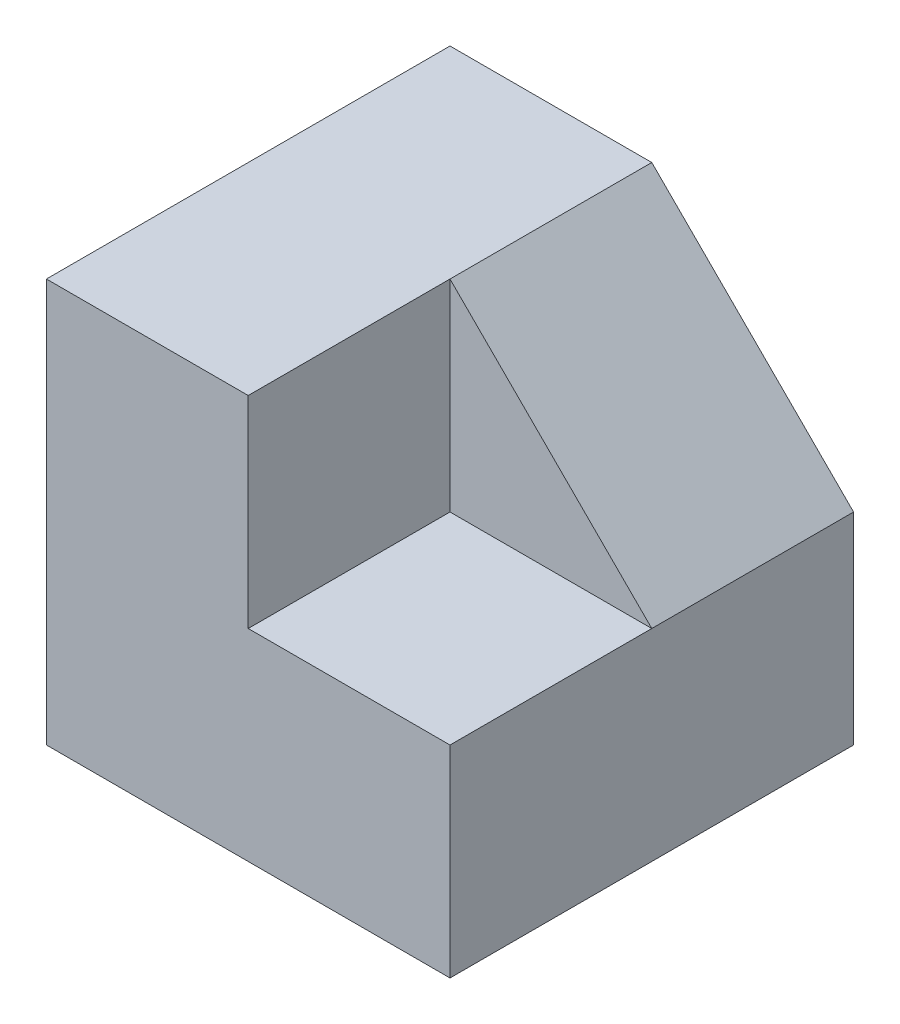
ISO-10303-21;
HEADER;
FILE_DESCRIPTION(('STEP AP214'),'2;1');
FILE_NAME('part.step','',(''),(''),'','','');
FILE_SCHEMA(('AUTOMOTIVE_DESIGN { 1 0 10303 214 1 1 1 1 }'));
ENDSEC;
DATA;
#1=APPLICATION_CONTEXT('core data for automotive mechanical design processes');
#2=APPLICATION_PROTOCOL_DEFINITION('international standard','automotive_design',2000,#1);
#3=PRODUCT_CONTEXT('',#1,'mechanical');
#4=PRODUCT('Part','Part','',(#3));
#5=PRODUCT_RELATED_PRODUCT_CATEGORY('part','',(#4));
#6=PRODUCT_DEFINITION_FORMATION('','',#4);
#7=PRODUCT_DEFINITION_CONTEXT('part definition',#1,'design');
#8=PRODUCT_DEFINITION('design','',#6,#7);
#9=PRODUCT_DEFINITION_SHAPE('','',#8);
#10=(LENGTH_UNIT() NAMED_UNIT(*) SI_UNIT(.MILLI.,.METRE.));
#11=(NAMED_UNIT(*) PLANE_ANGLE_UNIT() SI_UNIT($,.RADIAN.));
#12=(NAMED_UNIT(*) SI_UNIT($,.STERADIAN.) SOLID_ANGLE_UNIT());
#13=UNCERTAINTY_MEASURE_WITH_UNIT(LENGTH_MEASURE(1.E-05),#10,'distance_accuracy_value','');
#14=(GEOMETRIC_REPRESENTATION_CONTEXT(3) GLOBAL_UNCERTAINTY_ASSIGNED_CONTEXT((#13)) GLOBAL_UNIT_ASSIGNED_CONTEXT((#10,
#11,#12)) REPRESENTATION_CONTEXT('',''));
#15=CARTESIAN_POINT('',(0.,0.,0.));
#16=DIRECTION('',(0.,0.,1.));
#17=DIRECTION('',(1.,0.,0.));
#18=AXIS2_PLACEMENT_3D('',#15,#16,#17);
#19=CARTESIAN_POINT('',(0.,60.,0.));
#20=DIRECTION('',(1.,0.,0.));
#21=DIRECTION('',(0.,0.,-1.));
#22=AXIS2_PLACEMENT_3D('',#19,#20,#21);
#23=PLANE('',#22);
#24=DIRECTION('',(0.,0.,1.));
#25=VECTOR('',#24,1.);
#26=CARTESIAN_POINT('',(0.,0.,0.));
#27=LINE('',#26,#25);
#28=CARTESIAN_POINT('',(0.,0.,0.));
#29=VERTEX_POINT('',#28);
#30=CARTESIAN_POINT('',(0.,0.,60.));
#31=VERTEX_POINT('',#30);
#32=EDGE_CURVE('E92',#29,#31,#27,.T.);
#33=ORIENTED_EDGE('',*,*,#32,.T.);
#34=DIRECTION('',(0.,-1.,0.));
#35=VECTOR('',#34,1.);
#36=CARTESIAN_POINT('',(0.,60.,60.));
#37=LINE('',#36,#35);
#38=CARTESIAN_POINT('',(0.,60.,60.));
#39=VERTEX_POINT('',#38);
#40=EDGE_CURVE('E11',#39,#31,#37,.T.);
#41=ORIENTED_EDGE('',*,*,#40,.F.);
#42=DIRECTION('',(0.,0.,1.));
#43=VECTOR('',#42,1.);
#44=CARTESIAN_POINT('',(0.,60.,0.));
#45=LINE('',#44,#43);
#46=CARTESIAN_POINT('',(0.,60.,0.));
#47=VERTEX_POINT('',#46);
#48=EDGE_CURVE('E86',#47,#39,#45,.T.);
#49=ORIENTED_EDGE('',*,*,#48,.F.);
#50=DIRECTION('',(0.,-1.,0.));
#51=VECTOR('',#50,1.);
#52=CARTESIAN_POINT('',(0.,60.,0.));
#53=LINE('',#52,#51);
#54=EDGE_CURVE('E80',#47,#29,#53,.T.);
#55=ORIENTED_EDGE('',*,*,#54,.T.);
#56=EDGE_LOOP('',(#33,#41,#49,#55));
#57=FACE_BOUND('',#56,.T.);
#58=ADVANCED_FACE('F39',(#57),#23,.F.);
#59=CARTESIAN_POINT('',(0.,60.,60.));
#60=DIRECTION('',(0.,0.,-1.));
#61=DIRECTION('',(-1.,0.,0.));
#62=AXIS2_PLACEMENT_3D('',#59,#60,#61);
#63=PLANE('',#62);
#64=DIRECTION('',(1.,0.,0.));
#65=VECTOR('',#64,1.);
#66=CARTESIAN_POINT('',(60.,30.,60.));
#67=LINE('',#66,#65);
#68=CARTESIAN_POINT('',(30.,30.,60.));
#69=VERTEX_POINT('',#68);
#70=CARTESIAN_POINT('',(60.,30.,60.));
#71=VERTEX_POINT('',#70);
#72=EDGE_CURVE('E136',#69,#71,#67,.T.);
#73=ORIENTED_EDGE('',*,*,#72,.F.);
#74=DIRECTION('',(0.,1.,0.));
#75=VECTOR('',#74,1.);
#76=CARTESIAN_POINT('',(30.,30.,60.));
#77=LINE('',#76,#75);
#78=CARTESIAN_POINT('',(30.,60.,60.));
#79=VERTEX_POINT('',#78);
#80=EDGE_CURVE('E99',#69,#79,#77,.T.);
#81=ORIENTED_EDGE('',*,*,#80,.T.);
#82=DIRECTION('',(1.,0.,0.));
#83=VECTOR('',#82,1.);
#84=CARTESIAN_POINT('',(0.,60.,60.));
#85=LINE('',#84,#83);
#86=EDGE_CURVE('E125',#39,#79,#85,.T.);
#87=ORIENTED_EDGE('',*,*,#86,.F.);
#88=ORIENTED_EDGE('',*,*,#40,.T.);
#89=DIRECTION('',(1.,0.,0.));
#90=VECTOR('',#89,1.);
#91=CARTESIAN_POINT('',(0.,0.,60.));
#92=LINE('',#91,#90);
#93=CARTESIAN_POINT('',(60.,0.,60.));
#94=VERTEX_POINT('',#93);
#95=EDGE_CURVE('E97',#31,#94,#92,.T.);
#96=ORIENTED_EDGE('',*,*,#95,.T.);
#97=DIRECTION('',(0.,-1.,0.));
#98=VECTOR('',#97,1.);
#99=CARTESIAN_POINT('',(60.,60.,60.));
#100=LINE('',#99,#98);
#101=EDGE_CURVE('E48',#71,#94,#100,.T.);
#102=ORIENTED_EDGE('',*,*,#101,.F.);
#103=EDGE_LOOP('',(#73,#81,#87,#88,#96,#102));
#104=FACE_BOUND('',#103,.T.);
#105=ADVANCED_FACE('F123',(#104),#63,.F.);
#106=CARTESIAN_POINT('',(60.,60.,0.));
#107=DIRECTION('',(-1.,0.,0.));
#108=DIRECTION('',(0.,0.,1.));
#109=AXIS2_PLACEMENT_3D('',#106,#107,#108);
#110=PLANE('',#109);
#111=DIRECTION('',(0.,-1.,0.));
#112=VECTOR('',#111,1.);
#113=CARTESIAN_POINT('',(60.,60.,0.));
#114=LINE('',#113,#112);
#115=CARTESIAN_POINT('',(60.,30.,0.));
#116=VERTEX_POINT('',#115);
#117=CARTESIAN_POINT('',(60.,0.,0.));
#118=VERTEX_POINT('',#117);
#119=EDGE_CURVE('E74',#116,#118,#114,.T.);
#120=ORIENTED_EDGE('',*,*,#119,.F.);
#121=DIRECTION('',(0.,0.,1.));
#122=VECTOR('',#121,1.);
#123=CARTESIAN_POINT('',(60.,30.,0.));
#124=LINE('',#123,#122);
#125=CARTESIAN_POINT('',(60.,30.,30.));
#126=VERTEX_POINT('',#125);
#127=EDGE_CURVE('E142',#116,#126,#124,.T.);
#128=ORIENTED_EDGE('',*,*,#127,.T.);
#129=DIRECTION('',(0.,0.,-1.));
#130=VECTOR('',#129,1.);
#131=CARTESIAN_POINT('',(60.,30.,60.));
#132=LINE('',#131,#130);
#133=EDGE_CURVE('E120',#71,#126,#132,.T.);
#134=ORIENTED_EDGE('',*,*,#133,.F.);
#135=ORIENTED_EDGE('',*,*,#101,.T.);
#136=DIRECTION('',(0.,0.,-1.));
#137=VECTOR('',#136,1.);
#138=CARTESIAN_POINT('',(60.,0.,0.));
#139=LINE('',#138,#137);
#140=EDGE_CURVE('E87',#94,#118,#139,.T.);
#141=ORIENTED_EDGE('',*,*,#140,.T.);
#142=EDGE_LOOP('',(#120,#128,#134,#135,#141));
#143=FACE_BOUND('',#142,.T.);
#144=ADVANCED_FACE('F117',(#143),#110,.F.);
#145=CARTESIAN_POINT('',(0.,60.,0.));
#146=DIRECTION('',(0.,0.,1.));
#147=DIRECTION('',(1.,0.,0.));
#148=AXIS2_PLACEMENT_3D('',#145,#146,#147);
#149=PLANE('',#148);
#150=DIRECTION('',(-1.,0.,0.));
#151=VECTOR('',#150,1.);
#152=CARTESIAN_POINT('',(0.,60.,0.));
#153=LINE('',#152,#151);
#154=CARTESIAN_POINT('',(30.,60.,0.));
#155=VERTEX_POINT('',#154);
#156=EDGE_CURVE('E56',#155,#47,#153,.T.);
#157=ORIENTED_EDGE('',*,*,#156,.F.);
#158=DIRECTION('',(0.707106781186547,-0.707106781186547,0.));
#159=VECTOR('',#158,1.);
#160=CARTESIAN_POINT('',(30.,60.,0.));
#161=LINE('',#160,#159);
#162=EDGE_CURVE('E160',#155,#116,#161,.T.);
#163=ORIENTED_EDGE('',*,*,#162,.T.);
#164=ORIENTED_EDGE('',*,*,#119,.T.);
#165=DIRECTION('',(-1.,0.,0.));
#166=VECTOR('',#165,1.);
#167=CARTESIAN_POINT('',(0.,0.,0.));
#168=LINE('',#167,#166);
#169=EDGE_CURVE('E77',#118,#29,#168,.T.);
#170=ORIENTED_EDGE('',*,*,#169,.T.);
#171=ORIENTED_EDGE('',*,*,#54,.F.);
#172=EDGE_LOOP('',(#157,#163,#164,#170,#171));
#173=FACE_BOUND('',#172,.T.);
#174=ADVANCED_FACE('F79',(#173),#149,.F.);
#175=CARTESIAN_POINT('',(0.,60.,0.));
#176=DIRECTION('',(0.,1.,0.));
#177=DIRECTION('',(0.,0.,1.));
#178=AXIS2_PLACEMENT_3D('',#175,#176,#177);
#179=PLANE('',#178);
#180=DIRECTION('',(0.,0.,1.));
#181=VECTOR('',#180,1.);
#182=CARTESIAN_POINT('',(30.,60.,0.));
#183=LINE('',#182,#181);
#184=CARTESIAN_POINT('',(30.,60.,30.));
#185=VERTEX_POINT('',#184);
#186=EDGE_CURVE('E156',#155,#185,#183,.T.);
#187=ORIENTED_EDGE('',*,*,#186,.F.);
#188=ORIENTED_EDGE('',*,*,#156,.T.);
#189=ORIENTED_EDGE('',*,*,#48,.T.);
#190=ORIENTED_EDGE('',*,*,#86,.T.);
#191=DIRECTION('',(0.,0.,1.));
#192=VECTOR('',#191,1.);
#193=CARTESIAN_POINT('',(30.,60.,60.));
#194=LINE('',#193,#192);
#195=EDGE_CURVE('E138',#185,#79,#194,.T.);
#196=ORIENTED_EDGE('',*,*,#195,.F.);
#197=EDGE_LOOP('',(#187,#188,#189,#190,#196));
#198=FACE_BOUND('',#197,.T.);
#199=ADVANCED_FACE('F130',(#198),#179,.T.);
#200=CARTESIAN_POINT('',(0.,0.,0.));
#201=DIRECTION('',(0.,1.,0.));
#202=DIRECTION('',(0.,0.,1.));
#203=AXIS2_PLACEMENT_3D('',#200,#201,#202);
#204=PLANE('',#203);
#205=ORIENTED_EDGE('',*,*,#32,.F.);
#206=ORIENTED_EDGE('',*,*,#169,.F.);
#207=ORIENTED_EDGE('',*,*,#140,.F.);
#208=ORIENTED_EDGE('',*,*,#95,.F.);
#209=EDGE_LOOP('',(#205,#206,#207,#208));
#210=FACE_BOUND('',#209,.T.);
#211=ADVANCED_FACE('F95',(#210),#204,.F.);
#212=CARTESIAN_POINT('',(30.,30.,60.));
#213=DIRECTION('',(-1.,0.,0.));
#214=DIRECTION('',(0.,0.,1.));
#215=AXIS2_PLACEMENT_3D('',#212,#213,#214);
#216=PLANE('',#215);
#217=ORIENTED_EDGE('',*,*,#195,.T.);
#218=ORIENTED_EDGE('',*,*,#80,.F.);
#219=DIRECTION('',(0.,0.,1.));
#220=VECTOR('',#219,1.);
#221=CARTESIAN_POINT('',(30.,30.,60.));
#222=LINE('',#221,#220);
#223=CARTESIAN_POINT('',(30.,30.,30.));
#224=VERTEX_POINT('',#223);
#225=EDGE_CURVE('E146',#224,#69,#222,.T.);
#226=ORIENTED_EDGE('',*,*,#225,.F.);
#227=DIRECTION('',(0.,1.,0.));
#228=VECTOR('',#227,1.);
#229=CARTESIAN_POINT('',(30.,30.,30.));
#230=LINE('',#229,#228);
#231=EDGE_CURVE('E105',#224,#185,#230,.T.);
#232=ORIENTED_EDGE('',*,*,#231,.T.);
#233=EDGE_LOOP('',(#217,#218,#226,#232));
#234=FACE_BOUND('',#233,.T.);
#235=ADVANCED_FACE('F192',(#234),#216,.F.);
#236=CARTESIAN_POINT('',(60.,30.,30.));
#237=DIRECTION('',(0.,0.,-1.));
#238=DIRECTION('',(-1.,0.,0.));
#239=AXIS2_PLACEMENT_3D('',#236,#237,#238);
#240=PLANE('',#239);
#241=DIRECTION('',(-1.,0.,0.));
#242=VECTOR('',#241,1.);
#243=CARTESIAN_POINT('',(60.,30.,30.));
#244=LINE('',#243,#242);
#245=EDGE_CURVE('E150',#126,#224,#244,.T.);
#246=ORIENTED_EDGE('',*,*,#245,.F.);
#247=DIRECTION('',(0.707106781186547,-0.707106781186547,0.));
#248=VECTOR('',#247,1.);
#249=CARTESIAN_POINT('',(30.,60.,30.));
#250=LINE('',#249,#248);
#251=EDGE_CURVE('E163',#185,#126,#250,.T.);
#252=ORIENTED_EDGE('',*,*,#251,.F.);
#253=ORIENTED_EDGE('',*,*,#231,.F.);
#254=EDGE_LOOP('',(#246,#252,#253));
#255=FACE_BOUND('',#254,.T.);
#256=ADVANCED_FACE('F181',(#255),#240,.F.);
#257=CARTESIAN_POINT('',(0.,30.,0.));
#258=DIRECTION('',(0.,1.,0.));
#259=DIRECTION('',(0.,0.,1.));
#260=AXIS2_PLACEMENT_3D('',#257,#258,#259);
#261=PLANE('',#260);
#262=ORIENTED_EDGE('',*,*,#133,.T.);
#263=ORIENTED_EDGE('',*,*,#245,.T.);
#264=ORIENTED_EDGE('',*,*,#225,.T.);
#265=ORIENTED_EDGE('',*,*,#72,.T.);
#266=EDGE_LOOP('',(#262,#263,#264,#265));
#267=FACE_BOUND('',#266,.T.);
#268=ADVANCED_FACE('F185',(#267),#261,.T.);
#269=CARTESIAN_POINT('',(30.,60.,0.));
#270=DIRECTION('',(-0.707106781186547,-0.707106781186547,0.));
#271=DIRECTION('',(0.707106781186548,-0.707106781186548,0.));
#272=AXIS2_PLACEMENT_3D('',#269,#270,#271);
#273=PLANE('',#272);
#274=ORIENTED_EDGE('',*,*,#251,.T.);
#275=ORIENTED_EDGE('',*,*,#127,.F.);
#276=ORIENTED_EDGE('',*,*,#162,.F.);
#277=ORIENTED_EDGE('',*,*,#186,.T.);
#278=EDGE_LOOP('',(#274,#275,#276,#277));
#279=FACE_BOUND('',#278,.T.);
#280=ADVANCED_FACE('F194',(#279),#273,.F.);
#281=CLOSED_SHELL('',(#58,#105,#144,#174,#199,#211,#235,#256,#268,#280));
#282=MANIFOLD_SOLID_BREP('B2',#281);
#283=ADVANCED_BREP_SHAPE_REPRESENTATION('',(#18,#282),#14);
#284=SHAPE_DEFINITION_REPRESENTATION(#9,#283);
ENDSEC;
END-ISO-10303-21;
